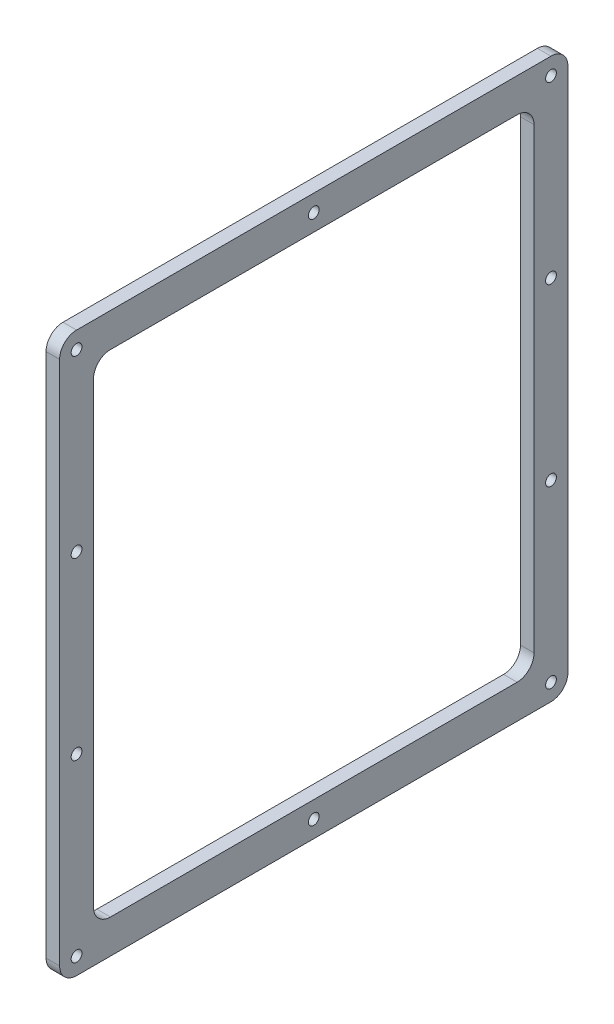
ISO-10303-21;
HEADER;
FILE_DESCRIPTION(('STEP AP214'),'2;1');
FILE_NAME('part.step','',(''),(''),'','','');
FILE_SCHEMA(('AUTOMOTIVE_DESIGN { 1 0 10303 214 1 1 1 1 }'));
ENDSEC;
DATA;
#1=APPLICATION_CONTEXT('core data for automotive mechanical design processes');
#2=APPLICATION_PROTOCOL_DEFINITION('international standard','automotive_design',2000,#1);
#3=PRODUCT_CONTEXT('',#1,'mechanical');
#4=PRODUCT('Part','Part','',(#3));
#5=PRODUCT_RELATED_PRODUCT_CATEGORY('part','',(#4));
#6=PRODUCT_DEFINITION_FORMATION('','',#4);
#7=PRODUCT_DEFINITION_CONTEXT('part definition',#1,'design');
#8=PRODUCT_DEFINITION('design','',#6,#7);
#9=PRODUCT_DEFINITION_SHAPE('','',#8);
#10=(LENGTH_UNIT() NAMED_UNIT(*) SI_UNIT(.MILLI.,.METRE.));
#11=(NAMED_UNIT(*) PLANE_ANGLE_UNIT() SI_UNIT($,.RADIAN.));
#12=(NAMED_UNIT(*) SI_UNIT($,.STERADIAN.) SOLID_ANGLE_UNIT());
#13=UNCERTAINTY_MEASURE_WITH_UNIT(LENGTH_MEASURE(1.E-05),#10,'distance_accuracy_value','');
#14=(GEOMETRIC_REPRESENTATION_CONTEXT(3) GLOBAL_UNCERTAINTY_ASSIGNED_CONTEXT((#13)) GLOBAL_UNIT_ASSIGNED_CONTEXT((#10,
#11,#12)) REPRESENTATION_CONTEXT('',''));
#15=CARTESIAN_POINT('',(0.,0.,0.));
#16=DIRECTION('',(0.,0.,1.));
#17=DIRECTION('',(1.,0.,0.));
#18=AXIS2_PLACEMENT_3D('',#15,#16,#17);
#19=CARTESIAN_POINT('',(5.08,0.,0.));
#20=DIRECTION('',(-1.,0.,0.));
#21=DIRECTION('',(0.,0.,1.));
#22=AXIS2_PLACEMENT_3D('',#19,#20,#21);
#23=PLANE('',#22);
#24=CARTESIAN_POINT('',(5.08,203.2,-6.35));
#25=DIRECTION('',(1.,0.,0.));
#26=DIRECTION('',(0.,0.,-1.));
#27=AXIS2_PLACEMENT_3D('',#24,#25,#26);
#28=CIRCLE('',#27,2.0193);
#29=CARTESIAN_POINT('',(5.08,203.2,-8.3693));
#30=VERTEX_POINT('',#29);
#31=EDGE_CURVE('E656',#30,#30,#28,.T.);
#32=ORIENTED_EDGE('',*,*,#31,.F.);
#33=EDGE_LOOP('',(#32));
#34=FACE_BOUND('',#33,.T.);
#35=CARTESIAN_POINT('',(5.08,6.35000000000003,-184.15));
#36=DIRECTION('',(1.,0.,0.));
#37=DIRECTION('',(0.,0.,-1.));
#38=AXIS2_PLACEMENT_3D('',#35,#36,#37);
#39=CIRCLE('',#38,2.0193);
#40=CARTESIAN_POINT('',(5.08,6.35000000000003,-186.1693));
#41=VERTEX_POINT('',#40);
#42=EDGE_CURVE('E651',#41,#41,#39,.T.);
#43=ORIENTED_EDGE('',*,*,#42,.F.);
#44=EDGE_LOOP('',(#43));
#45=FACE_BOUND('',#44,.T.);
#46=CARTESIAN_POINT('',(5.08,6.35,-6.35000000000003));
#47=DIRECTION('',(1.,0.,0.));
#48=DIRECTION('',(0.,0.,-1.));
#49=AXIS2_PLACEMENT_3D('',#46,#47,#48);
#50=CIRCLE('',#49,2.0193);
#51=CARTESIAN_POINT('',(5.08,6.35,-8.36930000000003));
#52=VERTEX_POINT('',#51);
#53=EDGE_CURVE('E645',#52,#52,#50,.T.);
#54=ORIENTED_EDGE('',*,*,#53,.F.);
#55=EDGE_LOOP('',(#54));
#56=FACE_BOUND('',#55,.T.);
#57=CARTESIAN_POINT('',(5.08,203.2,-184.15));
#58=DIRECTION('',(1.,0.,0.));
#59=DIRECTION('',(0.,0.,-1.));
#60=AXIS2_PLACEMENT_3D('',#57,#58,#59);
#61=CIRCLE('',#60,2.0193);
#62=CARTESIAN_POINT('',(5.08,203.2,-186.1693));
#63=VERTEX_POINT('',#62);
#64=EDGE_CURVE('E639',#63,#63,#61,.T.);
#65=ORIENTED_EDGE('',*,*,#64,.F.);
#66=EDGE_LOOP('',(#65));
#67=FACE_BOUND('',#66,.T.);
#68=CARTESIAN_POINT('',(5.08,6.35,-95.25));
#69=DIRECTION('',(1.,0.,0.));
#70=DIRECTION('',(0.,0.,-1.));
#71=AXIS2_PLACEMENT_3D('',#68,#69,#70);
#72=CIRCLE('',#71,2.0193);
#73=CARTESIAN_POINT('',(5.08,6.35,-97.2693));
#74=VERTEX_POINT('',#73);
#75=EDGE_CURVE('E633',#74,#74,#72,.T.);
#76=ORIENTED_EDGE('',*,*,#75,.F.);
#77=EDGE_LOOP('',(#76));
#78=FACE_BOUND('',#77,.T.);
#79=CARTESIAN_POINT('',(5.08,203.2,-95.25));
#80=DIRECTION('',(1.,0.,0.));
#81=DIRECTION('',(0.,0.,-1.));
#82=AXIS2_PLACEMENT_3D('',#79,#80,#81);
#83=CIRCLE('',#82,2.0193);
#84=CARTESIAN_POINT('',(5.08,203.2,-97.2693));
#85=VERTEX_POINT('',#84);
#86=EDGE_CURVE('E627',#85,#85,#83,.T.);
#87=ORIENTED_EDGE('',*,*,#86,.F.);
#88=EDGE_LOOP('',(#87));
#89=FACE_BOUND('',#88,.T.);
#90=CARTESIAN_POINT('',(5.08,137.583333333333,-6.35000000000001));
#91=DIRECTION('',(1.,0.,0.));
#92=DIRECTION('',(0.,0.,-1.));
#93=AXIS2_PLACEMENT_3D('',#90,#91,#92);
#94=CIRCLE('',#93,2.0193);
#95=CARTESIAN_POINT('',(5.08,137.583333333333,-8.36930000000001));
#96=VERTEX_POINT('',#95);
#97=EDGE_CURVE('E621',#96,#96,#94,.T.);
#98=ORIENTED_EDGE('',*,*,#97,.F.);
#99=EDGE_LOOP('',(#98));
#100=FACE_BOUND('',#99,.T.);
#101=CARTESIAN_POINT('',(5.08,71.9666666666667,-6.35000000000002));
#102=DIRECTION('',(1.,0.,0.));
#103=DIRECTION('',(0.,0.,-1.));
#104=AXIS2_PLACEMENT_3D('',#101,#102,#103);
#105=CIRCLE('',#104,2.0193);
#106=CARTESIAN_POINT('',(5.08,71.9666666666667,-8.36930000000002));
#107=VERTEX_POINT('',#106);
#108=EDGE_CURVE('E615',#107,#107,#105,.T.);
#109=ORIENTED_EDGE('',*,*,#108,.F.);
#110=EDGE_LOOP('',(#109));
#111=FACE_BOUND('',#110,.T.);
#112=CARTESIAN_POINT('',(5.08,71.9666666666667,-184.15));
#113=DIRECTION('',(1.,0.,0.));
#114=DIRECTION('',(0.,0.,-1.));
#115=AXIS2_PLACEMENT_3D('',#112,#113,#114);
#116=CIRCLE('',#115,2.0193);
#117=CARTESIAN_POINT('',(5.08,71.9666666666667,-186.1693));
#118=VERTEX_POINT('',#117);
#119=EDGE_CURVE('E601',#118,#118,#116,.T.);
#120=ORIENTED_EDGE('',*,*,#119,.F.);
#121=EDGE_LOOP('',(#120));
#122=FACE_BOUND('',#121,.T.);
#123=CARTESIAN_POINT('',(5.08,137.583333333333,-184.15));
#124=DIRECTION('',(1.,0.,0.));
#125=DIRECTION('',(0.,0.,-1.));
#126=AXIS2_PLACEMENT_3D('',#123,#124,#125);
#127=CIRCLE('',#126,2.0193);
#128=CARTESIAN_POINT('',(5.08,137.583333333333,-186.1693));
#129=VERTEX_POINT('',#128);
#130=EDGE_CURVE('E595',#129,#129,#127,.T.);
#131=ORIENTED_EDGE('',*,*,#130,.F.);
#132=EDGE_LOOP('',(#131));
#133=FACE_BOUND('',#132,.T.);
#134=DIRECTION('',(0.,0.,-1.));
#135=VECTOR('',#134,1.);
#136=CARTESIAN_POINT('',(5.08,0.,0.));
#137=LINE('',#136,#135);
#138=CARTESIAN_POINT('',(5.08,0.,-6.35));
#139=VERTEX_POINT('',#138);
#140=CARTESIAN_POINT('',(5.08,0.,-184.15));
#141=VERTEX_POINT('',#140);
#142=EDGE_CURVE('E271',#139,#141,#137,.T.);
#143=ORIENTED_EDGE('',*,*,#142,.T.);
#144=CARTESIAN_POINT('',(5.08,6.35,-184.15));
#145=DIRECTION('',(-1.,0.,0.));
#146=DIRECTION('',(0.,0.,1.));
#147=AXIS2_PLACEMENT_3D('',#144,#145,#146);
#148=CIRCLE('',#147,6.35);
#149=CARTESIAN_POINT('',(5.08,6.35,-190.5));
#150=VERTEX_POINT('',#149);
#151=EDGE_CURVE('E210',#141,#150,#148,.F.);
#152=ORIENTED_EDGE('',*,*,#151,.T.);
#153=DIRECTION('',(0.,1.,0.));
#154=VECTOR('',#153,1.);
#155=CARTESIAN_POINT('',(5.08,0.,-190.5));
#156=LINE('',#155,#154);
#157=CARTESIAN_POINT('',(5.08,203.2,-190.5));
#158=VERTEX_POINT('',#157);
#159=EDGE_CURVE('E176',#150,#158,#156,.T.);
#160=ORIENTED_EDGE('',*,*,#159,.T.);
#161=CARTESIAN_POINT('',(5.08,203.2,-184.15));
#162=DIRECTION('',(-1.,0.,0.));
#163=DIRECTION('',(0.,0.,1.));
#164=AXIS2_PLACEMENT_3D('',#161,#162,#163);
#165=CIRCLE('',#164,6.35);
#166=CARTESIAN_POINT('',(5.08,209.55,-184.15));
#167=VERTEX_POINT('',#166);
#168=EDGE_CURVE('E208',#158,#167,#165,.F.);
#169=ORIENTED_EDGE('',*,*,#168,.T.);
#170=DIRECTION('',(0.,0.,1.));
#171=VECTOR('',#170,1.);
#172=CARTESIAN_POINT('',(5.08,209.55,0.));
#173=LINE('',#172,#171);
#174=CARTESIAN_POINT('',(5.08,209.55,-6.35));
#175=VERTEX_POINT('',#174);
#176=EDGE_CURVE('E171',#167,#175,#173,.T.);
#177=ORIENTED_EDGE('',*,*,#176,.T.);
#178=CARTESIAN_POINT('',(5.08,203.2,-6.35));
#179=DIRECTION('',(-1.,0.,0.));
#180=DIRECTION('',(0.,0.,1.));
#181=AXIS2_PLACEMENT_3D('',#178,#179,#180);
#182=CIRCLE('',#181,6.35);
#183=CARTESIAN_POINT('',(5.08,203.2,0.));
#184=VERTEX_POINT('',#183);
#185=EDGE_CURVE('E206',#175,#184,#182,.F.);
#186=ORIENTED_EDGE('',*,*,#185,.T.);
#187=DIRECTION('',(0.,-1.,0.));
#188=VECTOR('',#187,1.);
#189=CARTESIAN_POINT('',(5.08,0.,0.));
#190=LINE('',#189,#188);
#191=CARTESIAN_POINT('',(5.08,6.35,0.));
#192=VERTEX_POINT('',#191);
#193=EDGE_CURVE('E268',#184,#192,#190,.T.);
#194=ORIENTED_EDGE('',*,*,#193,.T.);
#195=CARTESIAN_POINT('',(5.08,6.35,-6.35));
#196=DIRECTION('',(-1.,0.,0.));
#197=DIRECTION('',(0.,0.,1.));
#198=AXIS2_PLACEMENT_3D('',#195,#196,#197);
#199=CIRCLE('',#198,6.35);
#200=EDGE_CURVE('E204',#192,#139,#199,.F.);
#201=ORIENTED_EDGE('',*,*,#200,.T.);
#202=EDGE_LOOP('',(#143,#152,#160,#169,#177,#186,#194,#201));
#203=FACE_BOUND('',#202,.T.);
#204=DIRECTION('',(0.,-1.,0.));
#205=VECTOR('',#204,1.);
#206=CARTESIAN_POINT('',(5.08,196.85,-12.7));
#207=LINE('',#206,#205);
#208=CARTESIAN_POINT('',(5.08,190.5,-12.7));
#209=VERTEX_POINT('',#208);
#210=CARTESIAN_POINT('',(5.08,19.05,-12.7));
#211=VERTEX_POINT('',#210);
#212=EDGE_CURVE('E267',#209,#211,#207,.T.);
#213=ORIENTED_EDGE('',*,*,#212,.F.);
#214=CARTESIAN_POINT('',(5.08,190.5,-19.05));
#215=DIRECTION('',(-1.,0.,0.));
#216=DIRECTION('',(0.,0.,1.));
#217=AXIS2_PLACEMENT_3D('',#214,#215,#216);
#218=CIRCLE('',#217,6.35);
#219=CARTESIAN_POINT('',(5.08,196.85,-19.05));
#220=VERTEX_POINT('',#219);
#221=EDGE_CURVE('E51',#209,#220,#218,.T.);
#222=ORIENTED_EDGE('',*,*,#221,.T.);
#223=DIRECTION('',(0.,0.,1.));
#224=VECTOR('',#223,1.);
#225=CARTESIAN_POINT('',(5.08,196.85,-12.7));
#226=LINE('',#225,#224);
#227=CARTESIAN_POINT('',(5.08,196.85,-171.45));
#228=VERTEX_POINT('',#227);
#229=EDGE_CURVE('E252',#228,#220,#226,.T.);
#230=ORIENTED_EDGE('',*,*,#229,.F.);
#231=CARTESIAN_POINT('',(5.08,190.5,-171.45));
#232=DIRECTION('',(-1.,0.,0.));
#233=DIRECTION('',(0.,0.,1.));
#234=AXIS2_PLACEMENT_3D('',#231,#232,#233);
#235=CIRCLE('',#234,6.35);
#236=CARTESIAN_POINT('',(5.08,190.5,-177.8));
#237=VERTEX_POINT('',#236);
#238=EDGE_CURVE('E236',#228,#237,#235,.T.);
#239=ORIENTED_EDGE('',*,*,#238,.T.);
#240=DIRECTION('',(0.,1.,0.));
#241=VECTOR('',#240,1.);
#242=CARTESIAN_POINT('',(5.08,196.85,-177.8));
#243=LINE('',#242,#241);
#244=CARTESIAN_POINT('',(5.08,19.05,-177.8));
#245=VERTEX_POINT('',#244);
#246=EDGE_CURVE('E255',#245,#237,#243,.T.);
#247=ORIENTED_EDGE('',*,*,#246,.F.);
#248=CARTESIAN_POINT('',(5.08,19.05,-171.45));
#249=DIRECTION('',(-1.,0.,0.));
#250=DIRECTION('',(0.,0.,1.));
#251=AXIS2_PLACEMENT_3D('',#248,#249,#250);
#252=CIRCLE('',#251,6.35);
#253=CARTESIAN_POINT('',(5.08,12.7,-171.45));
#254=VERTEX_POINT('',#253);
#255=EDGE_CURVE('E232',#245,#254,#252,.T.);
#256=ORIENTED_EDGE('',*,*,#255,.T.);
#257=DIRECTION('',(0.,0.,-1.));
#258=VECTOR('',#257,1.);
#259=CARTESIAN_POINT('',(5.08,12.7,-12.7));
#260=LINE('',#259,#258);
#261=CARTESIAN_POINT('',(5.08,12.7,-19.05));
#262=VERTEX_POINT('',#261);
#263=EDGE_CURVE('E261',#262,#254,#260,.T.);
#264=ORIENTED_EDGE('',*,*,#263,.F.);
#265=CARTESIAN_POINT('',(5.08,19.05,-19.05));
#266=DIRECTION('',(-1.,0.,0.));
#267=DIRECTION('',(0.,0.,1.));
#268=AXIS2_PLACEMENT_3D('',#265,#266,#267);
#269=CIRCLE('',#268,6.35);
#270=EDGE_CURVE('E11',#262,#211,#269,.T.);
#271=ORIENTED_EDGE('',*,*,#270,.T.);
#272=EDGE_LOOP('',(#213,#222,#230,#239,#247,#256,#264,#271));
#273=FACE_BOUND('',#272,.T.);
#274=ADVANCED_FACE('F36',(#34,#45,#56,#67,#78,#89,#100,#111,#122,#133,#203,#273),#23,.F.);
#275=CARTESIAN_POINT('',(0.,0.,0.));
#276=DIRECTION('',(-1.,0.,0.));
#277=DIRECTION('',(0.,0.,1.));
#278=AXIS2_PLACEMENT_3D('',#275,#276,#277);
#279=PLANE('',#278);
#280=CARTESIAN_POINT('',(0.,203.2,-6.35));
#281=DIRECTION('',(1.,0.,0.));
#282=DIRECTION('',(0.,0.,-1.));
#283=AXIS2_PLACEMENT_3D('',#280,#281,#282);
#284=CIRCLE('',#283,2.0193);
#285=CARTESIAN_POINT('',(0.,203.2,-8.3693));
#286=VERTEX_POINT('',#285);
#287=EDGE_CURVE('E654',#286,#286,#284,.T.);
#288=ORIENTED_EDGE('',*,*,#287,.T.);
#289=EDGE_LOOP('',(#288));
#290=FACE_BOUND('',#289,.T.);
#291=CARTESIAN_POINT('',(0.,6.35000000000003,-184.15));
#292=DIRECTION('',(1.,0.,0.));
#293=DIRECTION('',(0.,0.,-1.));
#294=AXIS2_PLACEMENT_3D('',#291,#292,#293);
#295=CIRCLE('',#294,2.0193);
#296=CARTESIAN_POINT('',(0.,6.35000000000003,-186.1693));
#297=VERTEX_POINT('',#296);
#298=EDGE_CURVE('E648',#297,#297,#295,.T.);
#299=ORIENTED_EDGE('',*,*,#298,.T.);
#300=EDGE_LOOP('',(#299));
#301=FACE_BOUND('',#300,.T.);
#302=CARTESIAN_POINT('',(0.,6.35,-6.35000000000003));
#303=DIRECTION('',(1.,0.,0.));
#304=DIRECTION('',(0.,0.,-1.));
#305=AXIS2_PLACEMENT_3D('',#302,#303,#304);
#306=CIRCLE('',#305,2.0193);
#307=CARTESIAN_POINT('',(0.,6.35,-8.36930000000003));
#308=VERTEX_POINT('',#307);
#309=EDGE_CURVE('E642',#308,#308,#306,.T.);
#310=ORIENTED_EDGE('',*,*,#309,.T.);
#311=EDGE_LOOP('',(#310));
#312=FACE_BOUND('',#311,.T.);
#313=CARTESIAN_POINT('',(0.,203.2,-184.15));
#314=DIRECTION('',(1.,0.,0.));
#315=DIRECTION('',(0.,0.,-1.));
#316=AXIS2_PLACEMENT_3D('',#313,#314,#315);
#317=CIRCLE('',#316,2.0193);
#318=CARTESIAN_POINT('',(0.,203.2,-186.1693));
#319=VERTEX_POINT('',#318);
#320=EDGE_CURVE('E636',#319,#319,#317,.T.);
#321=ORIENTED_EDGE('',*,*,#320,.T.);
#322=EDGE_LOOP('',(#321));
#323=FACE_BOUND('',#322,.T.);
#324=CARTESIAN_POINT('',(0.,6.35,-95.25));
#325=DIRECTION('',(1.,0.,0.));
#326=DIRECTION('',(0.,0.,-1.));
#327=AXIS2_PLACEMENT_3D('',#324,#325,#326);
#328=CIRCLE('',#327,2.0193);
#329=CARTESIAN_POINT('',(0.,6.35,-97.2693));
#330=VERTEX_POINT('',#329);
#331=EDGE_CURVE('E630',#330,#330,#328,.T.);
#332=ORIENTED_EDGE('',*,*,#331,.T.);
#333=EDGE_LOOP('',(#332));
#334=FACE_BOUND('',#333,.T.);
#335=CARTESIAN_POINT('',(0.,203.2,-95.25));
#336=DIRECTION('',(1.,0.,0.));
#337=DIRECTION('',(0.,0.,-1.));
#338=AXIS2_PLACEMENT_3D('',#335,#336,#337);
#339=CIRCLE('',#338,2.0193);
#340=CARTESIAN_POINT('',(0.,203.2,-97.2693));
#341=VERTEX_POINT('',#340);
#342=EDGE_CURVE('E624',#341,#341,#339,.T.);
#343=ORIENTED_EDGE('',*,*,#342,.T.);
#344=EDGE_LOOP('',(#343));
#345=FACE_BOUND('',#344,.T.);
#346=CARTESIAN_POINT('',(0.,137.583333333333,-6.35000000000001));
#347=DIRECTION('',(1.,0.,0.));
#348=DIRECTION('',(0.,0.,-1.));
#349=AXIS2_PLACEMENT_3D('',#346,#347,#348);
#350=CIRCLE('',#349,2.0193);
#351=CARTESIAN_POINT('',(0.,137.583333333333,-8.36930000000001));
#352=VERTEX_POINT('',#351);
#353=EDGE_CURVE('E618',#352,#352,#350,.T.);
#354=ORIENTED_EDGE('',*,*,#353,.T.);
#355=EDGE_LOOP('',(#354));
#356=FACE_BOUND('',#355,.T.);
#357=CARTESIAN_POINT('',(0.,71.9666666666667,-6.35000000000002));
#358=DIRECTION('',(1.,0.,0.));
#359=DIRECTION('',(0.,0.,-1.));
#360=AXIS2_PLACEMENT_3D('',#357,#358,#359);
#361=CIRCLE('',#360,2.0193);
#362=CARTESIAN_POINT('',(0.,71.9666666666667,-8.36930000000002));
#363=VERTEX_POINT('',#362);
#364=EDGE_CURVE('E612',#363,#363,#361,.T.);
#365=ORIENTED_EDGE('',*,*,#364,.T.);
#366=EDGE_LOOP('',(#365));
#367=FACE_BOUND('',#366,.T.);
#368=CARTESIAN_POINT('',(0.,71.9666666666667,-184.15));
#369=DIRECTION('',(1.,0.,0.));
#370=DIRECTION('',(0.,0.,-1.));
#371=AXIS2_PLACEMENT_3D('',#368,#369,#370);
#372=CIRCLE('',#371,2.0193);
#373=CARTESIAN_POINT('',(0.,71.9666666666667,-186.1693));
#374=VERTEX_POINT('',#373);
#375=EDGE_CURVE('E597',#374,#374,#372,.T.);
#376=ORIENTED_EDGE('',*,*,#375,.T.);
#377=EDGE_LOOP('',(#376));
#378=FACE_BOUND('',#377,.T.);
#379=CARTESIAN_POINT('',(0.,137.583333333333,-184.15));
#380=DIRECTION('',(1.,0.,0.));
#381=DIRECTION('',(0.,0.,-1.));
#382=AXIS2_PLACEMENT_3D('',#379,#380,#381);
#383=CIRCLE('',#382,2.0193);
#384=CARTESIAN_POINT('',(0.,137.583333333333,-186.1693));
#385=VERTEX_POINT('',#384);
#386=EDGE_CURVE('E248',#385,#385,#383,.T.);
#387=ORIENTED_EDGE('',*,*,#386,.T.);
#388=EDGE_LOOP('',(#387));
#389=FACE_BOUND('',#388,.T.);
#390=DIRECTION('',(0.,1.,0.));
#391=VECTOR('',#390,1.);
#392=CARTESIAN_POINT('',(0.,0.,-190.5));
#393=LINE('',#392,#391);
#394=CARTESIAN_POINT('',(0.,6.35,-190.5));
#395=VERTEX_POINT('',#394);
#396=CARTESIAN_POINT('',(0.,203.2,-190.5));
#397=VERTEX_POINT('',#396);
#398=EDGE_CURVE('E277',#395,#397,#393,.T.);
#399=ORIENTED_EDGE('',*,*,#398,.F.);
#400=CARTESIAN_POINT('',(0.,6.35,-184.15));
#401=DIRECTION('',(-1.,0.,0.));
#402=DIRECTION('',(0.,0.,1.));
#403=AXIS2_PLACEMENT_3D('',#400,#401,#402);
#404=CIRCLE('',#403,6.35);
#405=CARTESIAN_POINT('',(0.,0.,-184.15));
#406=VERTEX_POINT('',#405);
#407=EDGE_CURVE('E197',#395,#406,#404,.T.);
#408=ORIENTED_EDGE('',*,*,#407,.T.);
#409=DIRECTION('',(0.,0.,-1.));
#410=VECTOR('',#409,1.);
#411=CARTESIAN_POINT('',(0.,0.,0.));
#412=LINE('',#411,#410);
#413=CARTESIAN_POINT('',(0.,0.,-6.35));
#414=VERTEX_POINT('',#413);
#415=EDGE_CURVE('E258',#414,#406,#412,.T.);
#416=ORIENTED_EDGE('',*,*,#415,.F.);
#417=CARTESIAN_POINT('',(0.,6.35,-6.35));
#418=DIRECTION('',(-1.,0.,0.));
#419=DIRECTION('',(0.,0.,1.));
#420=AXIS2_PLACEMENT_3D('',#417,#418,#419);
#421=CIRCLE('',#420,6.35);
#422=CARTESIAN_POINT('',(0.,6.35,0.));
#423=VERTEX_POINT('',#422);
#424=EDGE_CURVE('E191',#414,#423,#421,.T.);
#425=ORIENTED_EDGE('',*,*,#424,.T.);
#426=DIRECTION('',(0.,-1.,0.));
#427=VECTOR('',#426,1.);
#428=CARTESIAN_POINT('',(0.,0.,0.));
#429=LINE('',#428,#427);
#430=CARTESIAN_POINT('',(0.,203.2,0.));
#431=VERTEX_POINT('',#430);
#432=EDGE_CURVE('E254',#431,#423,#429,.T.);
#433=ORIENTED_EDGE('',*,*,#432,.F.);
#434=CARTESIAN_POINT('',(0.,203.2,-6.35));
#435=DIRECTION('',(-1.,0.,0.));
#436=DIRECTION('',(0.,0.,1.));
#437=AXIS2_PLACEMENT_3D('',#434,#435,#436);
#438=CIRCLE('',#437,6.35);
#439=CARTESIAN_POINT('',(0.,209.55,-6.35));
#440=VERTEX_POINT('',#439);
#441=EDGE_CURVE('E193',#431,#440,#438,.T.);
#442=ORIENTED_EDGE('',*,*,#441,.T.);
#443=DIRECTION('',(0.,0.,1.));
#444=VECTOR('',#443,1.);
#445=CARTESIAN_POINT('',(0.,209.55,0.));
#446=LINE('',#445,#444);
#447=CARTESIAN_POINT('',(0.,209.55,-184.15));
#448=VERTEX_POINT('',#447);
#449=EDGE_CURVE('E179',#448,#440,#446,.T.);
#450=ORIENTED_EDGE('',*,*,#449,.F.);
#451=CARTESIAN_POINT('',(0.,203.2,-184.15));
#452=DIRECTION('',(-1.,0.,0.));
#453=DIRECTION('',(0.,0.,1.));
#454=AXIS2_PLACEMENT_3D('',#451,#452,#453);
#455=CIRCLE('',#454,6.35);
#456=EDGE_CURVE('E195',#448,#397,#455,.T.);
#457=ORIENTED_EDGE('',*,*,#456,.T.);
#458=EDGE_LOOP('',(#399,#408,#416,#425,#433,#442,#450,#457));
#459=FACE_BOUND('',#458,.T.);
#460=DIRECTION('',(0.,1.,0.));
#461=VECTOR('',#460,1.);
#462=CARTESIAN_POINT('',(0.,196.85,-177.8));
#463=LINE('',#462,#461);
#464=CARTESIAN_POINT('',(0.,19.05,-177.8));
#465=VERTEX_POINT('',#464);
#466=CARTESIAN_POINT('',(0.,190.5,-177.8));
#467=VERTEX_POINT('',#466);
#468=EDGE_CURVE('E168',#465,#467,#463,.T.);
#469=ORIENTED_EDGE('',*,*,#468,.T.);
#470=CARTESIAN_POINT('',(0.,190.5,-171.45));
#471=DIRECTION('',(-1.,0.,0.));
#472=DIRECTION('',(0.,0.,1.));
#473=AXIS2_PLACEMENT_3D('',#470,#471,#472);
#474=CIRCLE('',#473,6.35);
#475=CARTESIAN_POINT('',(0.,196.85,-171.45));
#476=VERTEX_POINT('',#475);
#477=EDGE_CURVE('E234',#467,#476,#474,.F.);
#478=ORIENTED_EDGE('',*,*,#477,.T.);
#479=DIRECTION('',(0.,0.,1.));
#480=VECTOR('',#479,1.);
#481=CARTESIAN_POINT('',(0.,196.85,-12.7));
#482=LINE('',#481,#480);
#483=CARTESIAN_POINT('',(0.,196.85,-19.05));
#484=VERTEX_POINT('',#483);
#485=EDGE_CURVE('E241',#476,#484,#482,.T.);
#486=ORIENTED_EDGE('',*,*,#485,.T.);
#487=CARTESIAN_POINT('',(0.,190.5,-19.05));
#488=DIRECTION('',(-1.,0.,0.));
#489=DIRECTION('',(0.,0.,1.));
#490=AXIS2_PLACEMENT_3D('',#487,#488,#489);
#491=CIRCLE('',#490,6.35);
#492=CARTESIAN_POINT('',(0.,190.5,-12.7));
#493=VERTEX_POINT('',#492);
#494=EDGE_CURVE('E238',#484,#493,#491,.F.);
#495=ORIENTED_EDGE('',*,*,#494,.T.);
#496=DIRECTION('',(0.,-1.,0.));
#497=VECTOR('',#496,1.);
#498=CARTESIAN_POINT('',(0.,196.85,-12.7));
#499=LINE('',#498,#497);
#500=CARTESIAN_POINT('',(0.,19.05,-12.7));
#501=VERTEX_POINT('',#500);
#502=EDGE_CURVE('E155',#493,#501,#499,.T.);
#503=ORIENTED_EDGE('',*,*,#502,.T.);
#504=CARTESIAN_POINT('',(0.,19.05,-19.05));
#505=DIRECTION('',(-1.,0.,0.));
#506=DIRECTION('',(0.,0.,1.));
#507=AXIS2_PLACEMENT_3D('',#504,#505,#506);
#508=CIRCLE('',#507,6.35);
#509=CARTESIAN_POINT('',(0.,12.7,-19.05));
#510=VERTEX_POINT('',#509);
#511=EDGE_CURVE('E44',#501,#510,#508,.F.);
#512=ORIENTED_EDGE('',*,*,#511,.T.);
#513=DIRECTION('',(0.,0.,-1.));
#514=VECTOR('',#513,1.);
#515=CARTESIAN_POINT('',(0.,12.7,-12.7));
#516=LINE('',#515,#514);
#517=CARTESIAN_POINT('',(0.,12.7,-171.45));
#518=VERTEX_POINT('',#517);
#519=EDGE_CURVE('E153',#510,#518,#516,.T.);
#520=ORIENTED_EDGE('',*,*,#519,.T.);
#521=CARTESIAN_POINT('',(0.,19.05,-171.45));
#522=DIRECTION('',(-1.,0.,0.));
#523=DIRECTION('',(0.,0.,1.));
#524=AXIS2_PLACEMENT_3D('',#521,#522,#523);
#525=CIRCLE('',#524,6.35);
#526=EDGE_CURVE('E230',#518,#465,#525,.F.);
#527=ORIENTED_EDGE('',*,*,#526,.T.);
#528=EDGE_LOOP('',(#469,#478,#486,#495,#503,#512,#520,#527));
#529=FACE_BOUND('',#528,.T.);
#530=ADVANCED_FACE('F152',(#290,#301,#312,#323,#334,#345,#356,#367,#378,#389,#459,#529),#279,.T.);
#531=CARTESIAN_POINT('',(5.08,0.,0.));
#532=DIRECTION('',(0.,0.,-1.));
#533=DIRECTION('',(-1.,0.,0.));
#534=AXIS2_PLACEMENT_3D('',#531,#532,#533);
#535=PLANE('',#534);
#536=ORIENTED_EDGE('',*,*,#193,.F.);
#537=DIRECTION('',(-1.,0.,0.));
#538=VECTOR('',#537,1.);
#539=CARTESIAN_POINT('',(5.08,203.2,0.));
#540=LINE('',#539,#538);
#541=EDGE_CURVE('E223',#184,#431,#540,.T.);
#542=ORIENTED_EDGE('',*,*,#541,.T.);
#543=ORIENTED_EDGE('',*,*,#432,.T.);
#544=DIRECTION('',(-1.,0.,0.));
#545=VECTOR('',#544,1.);
#546=CARTESIAN_POINT('',(5.08,6.35,0.));
#547=LINE('',#546,#545);
#548=EDGE_CURVE('E221',#423,#192,#547,.F.);
#549=ORIENTED_EDGE('',*,*,#548,.T.);
#550=EDGE_LOOP('',(#536,#542,#543,#549));
#551=FACE_BOUND('',#550,.T.);
#552=ADVANCED_FACE('F298',(#551),#535,.F.);
#553=CARTESIAN_POINT('',(5.08,0.,0.));
#554=DIRECTION('',(0.,1.,0.));
#555=DIRECTION('',(0.,0.,1.));
#556=AXIS2_PLACEMENT_3D('',#553,#554,#555);
#557=PLANE('',#556);
#558=ORIENTED_EDGE('',*,*,#415,.T.);
#559=DIRECTION('',(-1.,0.,0.));
#560=VECTOR('',#559,1.);
#561=CARTESIAN_POINT('',(5.08,0.,-184.15));
#562=LINE('',#561,#560);
#563=EDGE_CURVE('E202',#406,#141,#562,.F.);
#564=ORIENTED_EDGE('',*,*,#563,.T.);
#565=ORIENTED_EDGE('',*,*,#142,.F.);
#566=DIRECTION('',(-1.,0.,0.));
#567=VECTOR('',#566,1.);
#568=CARTESIAN_POINT('',(5.08,0.,-6.35));
#569=LINE('',#568,#567);
#570=EDGE_CURVE('E199',#139,#414,#569,.T.);
#571=ORIENTED_EDGE('',*,*,#570,.T.);
#572=EDGE_LOOP('',(#558,#564,#565,#571));
#573=FACE_BOUND('',#572,.T.);
#574=ADVANCED_FACE('F307',(#573),#557,.F.);
#575=CARTESIAN_POINT('',(5.08,0.,-190.5));
#576=DIRECTION('',(0.,0.,1.));
#577=DIRECTION('',(1.,0.,0.));
#578=AXIS2_PLACEMENT_3D('',#575,#576,#577);
#579=PLANE('',#578);
#580=ORIENTED_EDGE('',*,*,#159,.F.);
#581=DIRECTION('',(-1.,0.,0.));
#582=VECTOR('',#581,1.);
#583=CARTESIAN_POINT('',(5.08,6.35,-190.5));
#584=LINE('',#583,#582);
#585=EDGE_CURVE('E188',#150,#395,#584,.T.);
#586=ORIENTED_EDGE('',*,*,#585,.T.);
#587=ORIENTED_EDGE('',*,*,#398,.T.);
#588=DIRECTION('',(-1.,0.,0.));
#589=VECTOR('',#588,1.);
#590=CARTESIAN_POINT('',(5.08,203.2,-190.5));
#591=LINE('',#590,#589);
#592=EDGE_CURVE('E186',#397,#158,#591,.F.);
#593=ORIENTED_EDGE('',*,*,#592,.T.);
#594=EDGE_LOOP('',(#580,#586,#587,#593));
#595=FACE_BOUND('',#594,.T.);
#596=ADVANCED_FACE('F315',(#595),#579,.F.);
#597=CARTESIAN_POINT('',(5.08,209.55,0.));
#598=DIRECTION('',(0.,-1.,0.));
#599=DIRECTION('',(0.,0.,-1.));
#600=AXIS2_PLACEMENT_3D('',#597,#598,#599);
#601=PLANE('',#600);
#602=ORIENTED_EDGE('',*,*,#176,.F.);
#603=DIRECTION('',(-1.,0.,0.));
#604=VECTOR('',#603,1.);
#605=CARTESIAN_POINT('',(5.08,209.55,-184.15));
#606=LINE('',#605,#604);
#607=EDGE_CURVE('E214',#167,#448,#606,.T.);
#608=ORIENTED_EDGE('',*,*,#607,.T.);
#609=ORIENTED_EDGE('',*,*,#449,.T.);
#610=DIRECTION('',(-1.,0.,0.));
#611=VECTOR('',#610,1.);
#612=CARTESIAN_POINT('',(5.08,209.55,-6.35));
#613=LINE('',#612,#611);
#614=EDGE_CURVE('E212',#440,#175,#613,.F.);
#615=ORIENTED_EDGE('',*,*,#614,.T.);
#616=EDGE_LOOP('',(#602,#608,#609,#615));
#617=FACE_BOUND('',#616,.T.);
#618=ADVANCED_FACE('F287',(#617),#601,.F.);
#619=CARTESIAN_POINT('',(5.08,196.85,-12.7));
#620=DIRECTION('',(0.,0.,-1.));
#621=DIRECTION('',(0.,1.,0.));
#622=AXIS2_PLACEMENT_3D('',#619,#620,#621);
#623=PLANE('',#622);
#624=ORIENTED_EDGE('',*,*,#502,.F.);
#625=DIRECTION('',(-1.,0.,0.));
#626=VECTOR('',#625,1.);
#627=CARTESIAN_POINT('',(5.08,190.5,-12.7));
#628=LINE('',#627,#626);
#629=EDGE_CURVE('E228',#493,#209,#628,.F.);
#630=ORIENTED_EDGE('',*,*,#629,.T.);
#631=ORIENTED_EDGE('',*,*,#212,.T.);
#632=DIRECTION('',(-1.,0.,0.));
#633=VECTOR('',#632,1.);
#634=CARTESIAN_POINT('',(0.,19.05,-12.7));
#635=LINE('',#634,#633);
#636=EDGE_CURVE('E226',#211,#501,#635,.T.);
#637=ORIENTED_EDGE('',*,*,#636,.T.);
#638=EDGE_LOOP('',(#624,#630,#631,#637));
#639=FACE_BOUND('',#638,.T.);
#640=ADVANCED_FACE('F246',(#639),#623,.T.);
#641=CARTESIAN_POINT('',(5.08,12.7,-12.7));
#642=DIRECTION('',(0.,1.,0.));
#643=DIRECTION('',(0.,0.,1.));
#644=AXIS2_PLACEMENT_3D('',#641,#642,#643);
#645=PLANE('',#644);
#646=ORIENTED_EDGE('',*,*,#263,.T.);
#647=DIRECTION('',(-1.,0.,0.));
#648=VECTOR('',#647,1.);
#649=CARTESIAN_POINT('',(0.,12.7,-171.45));
#650=LINE('',#649,#648);
#651=EDGE_CURVE('E167',#254,#518,#650,.T.);
#652=ORIENTED_EDGE('',*,*,#651,.T.);
#653=ORIENTED_EDGE('',*,*,#519,.F.);
#654=DIRECTION('',(-1.,0.,0.));
#655=VECTOR('',#654,1.);
#656=CARTESIAN_POINT('',(5.08,12.7,-19.05));
#657=LINE('',#656,#655);
#658=EDGE_CURVE('E164',#510,#262,#657,.F.);
#659=ORIENTED_EDGE('',*,*,#658,.T.);
#660=EDGE_LOOP('',(#646,#652,#653,#659));
#661=FACE_BOUND('',#660,.T.);
#662=ADVANCED_FACE('F163',(#661),#645,.T.);
#663=CARTESIAN_POINT('',(5.08,196.85,-177.8));
#664=DIRECTION('',(0.,0.,1.));
#665=DIRECTION('',(0.,-1.,0.));
#666=AXIS2_PLACEMENT_3D('',#663,#664,#665);
#667=PLANE('',#666);
#668=ORIENTED_EDGE('',*,*,#468,.F.);
#669=DIRECTION('',(-1.,0.,0.));
#670=VECTOR('',#669,1.);
#671=CARTESIAN_POINT('',(5.08,19.05,-177.8));
#672=LINE('',#671,#670);
#673=EDGE_CURVE('E184',#465,#245,#672,.F.);
#674=ORIENTED_EDGE('',*,*,#673,.T.);
#675=ORIENTED_EDGE('',*,*,#246,.T.);
#676=DIRECTION('',(-1.,0.,0.));
#677=VECTOR('',#676,1.);
#678=CARTESIAN_POINT('',(0.,190.5,-177.8));
#679=LINE('',#678,#677);
#680=EDGE_CURVE('E173',#237,#467,#679,.T.);
#681=ORIENTED_EDGE('',*,*,#680,.T.);
#682=EDGE_LOOP('',(#668,#674,#675,#681));
#683=FACE_BOUND('',#682,.T.);
#684=ADVANCED_FACE('F412',(#683),#667,.T.);
#685=CARTESIAN_POINT('',(5.08,196.85,-12.7));
#686=DIRECTION('',(0.,-1.,0.));
#687=DIRECTION('',(0.,0.,-1.));
#688=AXIS2_PLACEMENT_3D('',#685,#686,#687);
#689=PLANE('',#688);
#690=ORIENTED_EDGE('',*,*,#485,.F.);
#691=DIRECTION('',(-1.,0.,0.));
#692=VECTOR('',#691,1.);
#693=CARTESIAN_POINT('',(5.08,196.85,-171.45));
#694=LINE('',#693,#692);
#695=EDGE_CURVE('E58',#476,#228,#694,.F.);
#696=ORIENTED_EDGE('',*,*,#695,.T.);
#697=ORIENTED_EDGE('',*,*,#229,.T.);
#698=DIRECTION('',(-1.,0.,0.));
#699=VECTOR('',#698,1.);
#700=CARTESIAN_POINT('',(0.,196.85,-19.05));
#701=LINE('',#700,#699);
#702=EDGE_CURVE('E217',#220,#484,#701,.T.);
#703=ORIENTED_EDGE('',*,*,#702,.T.);
#704=EDGE_LOOP('',(#690,#696,#697,#703));
#705=FACE_BOUND('',#704,.T.);
#706=ADVANCED_FACE('F251',(#705),#689,.T.);
#707=CARTESIAN_POINT('',(5.08,137.583333333333,-184.15));
#708=DIRECTION('',(1.,0.,0.));
#709=DIRECTION('',(0.,0.,-1.));
#710=AXIS2_PLACEMENT_3D('',#707,#708,#709);
#711=CYLINDRICAL_SURFACE('',#710,2.0193);
#712=ORIENTED_EDGE('',*,*,#386,.F.);
#713=EDGE_LOOP('',(#712));
#714=FACE_BOUND('',#713,.T.);
#715=ORIENTED_EDGE('',*,*,#130,.T.);
#716=EDGE_LOOP('',(#715));
#717=FACE_BOUND('',#716,.T.);
#718=ADVANCED_FACE('F411',(#714,#717),#711,.F.);
#719=CARTESIAN_POINT('',(5.08,71.9666666666667,-184.15));
#720=DIRECTION('',(1.,0.,0.));
#721=DIRECTION('',(0.,0.,-1.));
#722=AXIS2_PLACEMENT_3D('',#719,#720,#721);
#723=CYLINDRICAL_SURFACE('',#722,2.0193);
#724=ORIENTED_EDGE('',*,*,#375,.F.);
#725=EDGE_LOOP('',(#724));
#726=FACE_BOUND('',#725,.T.);
#727=ORIENTED_EDGE('',*,*,#119,.T.);
#728=EDGE_LOOP('',(#727));
#729=FACE_BOUND('',#728,.T.);
#730=ADVANCED_FACE('F557',(#726,#729),#723,.F.);
#731=CARTESIAN_POINT('',(5.08,71.9666666666667,-6.35000000000002));
#732=DIRECTION('',(1.,0.,0.));
#733=DIRECTION('',(0.,0.,-1.));
#734=AXIS2_PLACEMENT_3D('',#731,#732,#733);
#735=CYLINDRICAL_SURFACE('',#734,2.0193);
#736=ORIENTED_EDGE('',*,*,#364,.F.);
#737=EDGE_LOOP('',(#736));
#738=FACE_BOUND('',#737,.T.);
#739=ORIENTED_EDGE('',*,*,#108,.T.);
#740=EDGE_LOOP('',(#739));
#741=FACE_BOUND('',#740,.T.);
#742=ADVANCED_FACE('F546',(#738,#741),#735,.F.);
#743=CARTESIAN_POINT('',(5.08,137.583333333333,-6.35000000000001));
#744=DIRECTION('',(1.,0.,0.));
#745=DIRECTION('',(0.,0.,-1.));
#746=AXIS2_PLACEMENT_3D('',#743,#744,#745);
#747=CYLINDRICAL_SURFACE('',#746,2.0193);
#748=ORIENTED_EDGE('',*,*,#353,.F.);
#749=EDGE_LOOP('',(#748));
#750=FACE_BOUND('',#749,.T.);
#751=ORIENTED_EDGE('',*,*,#97,.T.);
#752=EDGE_LOOP('',(#751));
#753=FACE_BOUND('',#752,.T.);
#754=ADVANCED_FACE('F535',(#750,#753),#747,.F.);
#755=CARTESIAN_POINT('',(5.08,203.2,-95.25));
#756=DIRECTION('',(1.,0.,0.));
#757=DIRECTION('',(0.,0.,-1.));
#758=AXIS2_PLACEMENT_3D('',#755,#756,#757);
#759=CYLINDRICAL_SURFACE('',#758,2.0193);
#760=ORIENTED_EDGE('',*,*,#342,.F.);
#761=EDGE_LOOP('',(#760));
#762=FACE_BOUND('',#761,.T.);
#763=ORIENTED_EDGE('',*,*,#86,.T.);
#764=EDGE_LOOP('',(#763));
#765=FACE_BOUND('',#764,.T.);
#766=ADVANCED_FACE('F524',(#762,#765),#759,.F.);
#767=CARTESIAN_POINT('',(5.08,6.35,-95.25));
#768=DIRECTION('',(1.,0.,0.));
#769=DIRECTION('',(0.,0.,-1.));
#770=AXIS2_PLACEMENT_3D('',#767,#768,#769);
#771=CYLINDRICAL_SURFACE('',#770,2.0193);
#772=ORIENTED_EDGE('',*,*,#331,.F.);
#773=EDGE_LOOP('',(#772));
#774=FACE_BOUND('',#773,.T.);
#775=ORIENTED_EDGE('',*,*,#75,.T.);
#776=EDGE_LOOP('',(#775));
#777=FACE_BOUND('',#776,.T.);
#778=ADVANCED_FACE('F513',(#774,#777),#771,.F.);
#779=CARTESIAN_POINT('',(5.08,203.2,-184.15));
#780=DIRECTION('',(1.,0.,0.));
#781=DIRECTION('',(0.,0.,-1.));
#782=AXIS2_PLACEMENT_3D('',#779,#780,#781);
#783=CYLINDRICAL_SURFACE('',#782,2.0193);
#784=ORIENTED_EDGE('',*,*,#320,.F.);
#785=EDGE_LOOP('',(#784));
#786=FACE_BOUND('',#785,.T.);
#787=ORIENTED_EDGE('',*,*,#64,.T.);
#788=EDGE_LOOP('',(#787));
#789=FACE_BOUND('',#788,.T.);
#790=ADVANCED_FACE('F502',(#786,#789),#783,.F.);
#791=CARTESIAN_POINT('',(5.08,6.35,-6.35000000000003));
#792=DIRECTION('',(1.,0.,0.));
#793=DIRECTION('',(0.,0.,-1.));
#794=AXIS2_PLACEMENT_3D('',#791,#792,#793);
#795=CYLINDRICAL_SURFACE('',#794,2.0193);
#796=ORIENTED_EDGE('',*,*,#309,.F.);
#797=EDGE_LOOP('',(#796));
#798=FACE_BOUND('',#797,.T.);
#799=ORIENTED_EDGE('',*,*,#53,.T.);
#800=EDGE_LOOP('',(#799));
#801=FACE_BOUND('',#800,.T.);
#802=ADVANCED_FACE('F491',(#798,#801),#795,.F.);
#803=CARTESIAN_POINT('',(5.08,6.35000000000003,-184.15));
#804=DIRECTION('',(1.,0.,0.));
#805=DIRECTION('',(0.,0.,-1.));
#806=AXIS2_PLACEMENT_3D('',#803,#804,#805);
#807=CYLINDRICAL_SURFACE('',#806,2.0193);
#808=ORIENTED_EDGE('',*,*,#298,.F.);
#809=EDGE_LOOP('',(#808));
#810=FACE_BOUND('',#809,.T.);
#811=ORIENTED_EDGE('',*,*,#42,.T.);
#812=EDGE_LOOP('',(#811));
#813=FACE_BOUND('',#812,.T.);
#814=ADVANCED_FACE('F480',(#810,#813),#807,.F.);
#815=CARTESIAN_POINT('',(5.08,203.2,-6.35));
#816=DIRECTION('',(1.,0.,0.));
#817=DIRECTION('',(0.,0.,-1.));
#818=AXIS2_PLACEMENT_3D('',#815,#816,#817);
#819=CYLINDRICAL_SURFACE('',#818,2.0193);
#820=ORIENTED_EDGE('',*,*,#287,.F.);
#821=EDGE_LOOP('',(#820));
#822=FACE_BOUND('',#821,.T.);
#823=ORIENTED_EDGE('',*,*,#31,.T.);
#824=EDGE_LOOP('',(#823));
#825=FACE_BOUND('',#824,.T.);
#826=ADVANCED_FACE('F341',(#822,#825),#819,.F.);
#827=CARTESIAN_POINT('',(5.08,19.05,-171.45));
#828=DIRECTION('',(1.,0.,0.));
#829=DIRECTION('',(0.,0.,-1.));
#830=AXIS2_PLACEMENT_3D('',#827,#828,#829);
#831=CYLINDRICAL_SURFACE('',#830,6.35);
#832=ORIENTED_EDGE('',*,*,#255,.F.);
#833=ORIENTED_EDGE('',*,*,#673,.F.);
#834=ORIENTED_EDGE('',*,*,#526,.F.);
#835=ORIENTED_EDGE('',*,*,#651,.F.);
#836=EDGE_LOOP('',(#832,#833,#834,#835));
#837=FACE_BOUND('',#836,.T.);
#838=ADVANCED_FACE('F338',(#837),#831,.F.);
#839=CARTESIAN_POINT('',(5.08,6.35,-184.15));
#840=DIRECTION('',(-1.,0.,0.));
#841=DIRECTION('',(0.,0.,1.));
#842=AXIS2_PLACEMENT_3D('',#839,#840,#841);
#843=CYLINDRICAL_SURFACE('',#842,6.35);
#844=ORIENTED_EDGE('',*,*,#151,.F.);
#845=ORIENTED_EDGE('',*,*,#563,.F.);
#846=ORIENTED_EDGE('',*,*,#407,.F.);
#847=ORIENTED_EDGE('',*,*,#585,.F.);
#848=EDGE_LOOP('',(#844,#845,#846,#847));
#849=FACE_BOUND('',#848,.T.);
#850=ADVANCED_FACE('F311',(#849),#843,.T.);
#851=CARTESIAN_POINT('',(5.08,203.2,-184.15));
#852=DIRECTION('',(-1.,0.,0.));
#853=DIRECTION('',(0.,0.,1.));
#854=AXIS2_PLACEMENT_3D('',#851,#852,#853);
#855=CYLINDRICAL_SURFACE('',#854,6.35);
#856=ORIENTED_EDGE('',*,*,#168,.F.);
#857=ORIENTED_EDGE('',*,*,#592,.F.);
#858=ORIENTED_EDGE('',*,*,#456,.F.);
#859=ORIENTED_EDGE('',*,*,#607,.F.);
#860=EDGE_LOOP('',(#856,#857,#858,#859));
#861=FACE_BOUND('',#860,.T.);
#862=ADVANCED_FACE('F317',(#861),#855,.T.);
#863=CARTESIAN_POINT('',(5.08,190.5,-171.45));
#864=DIRECTION('',(1.,0.,0.));
#865=DIRECTION('',(0.,0.,-1.));
#866=AXIS2_PLACEMENT_3D('',#863,#864,#865);
#867=CYLINDRICAL_SURFACE('',#866,6.35);
#868=ORIENTED_EDGE('',*,*,#238,.F.);
#869=ORIENTED_EDGE('',*,*,#695,.F.);
#870=ORIENTED_EDGE('',*,*,#477,.F.);
#871=ORIENTED_EDGE('',*,*,#680,.F.);
#872=EDGE_LOOP('',(#868,#869,#870,#871));
#873=FACE_BOUND('',#872,.T.);
#874=ADVANCED_FACE('F347',(#873),#867,.F.);
#875=CARTESIAN_POINT('',(5.08,203.2,-6.35));
#876=DIRECTION('',(-1.,0.,0.));
#877=DIRECTION('',(0.,0.,1.));
#878=AXIS2_PLACEMENT_3D('',#875,#876,#877);
#879=CYLINDRICAL_SURFACE('',#878,6.35);
#880=ORIENTED_EDGE('',*,*,#185,.F.);
#881=ORIENTED_EDGE('',*,*,#614,.F.);
#882=ORIENTED_EDGE('',*,*,#441,.F.);
#883=ORIENTED_EDGE('',*,*,#541,.F.);
#884=EDGE_LOOP('',(#880,#881,#882,#883));
#885=FACE_BOUND('',#884,.T.);
#886=ADVANCED_FACE('F292',(#885),#879,.T.);
#887=CARTESIAN_POINT('',(5.08,190.5,-19.05));
#888=DIRECTION('',(1.,0.,0.));
#889=DIRECTION('',(0.,0.,-1.));
#890=AXIS2_PLACEMENT_3D('',#887,#888,#889);
#891=CYLINDRICAL_SURFACE('',#890,6.35);
#892=ORIENTED_EDGE('',*,*,#221,.F.);
#893=ORIENTED_EDGE('',*,*,#629,.F.);
#894=ORIENTED_EDGE('',*,*,#494,.F.);
#895=ORIENTED_EDGE('',*,*,#702,.F.);
#896=EDGE_LOOP('',(#892,#893,#894,#895));
#897=FACE_BOUND('',#896,.T.);
#898=ADVANCED_FACE('F250',(#897),#891,.F.);
#899=CARTESIAN_POINT('',(5.08,6.35,-6.35));
#900=DIRECTION('',(-1.,0.,0.));
#901=DIRECTION('',(0.,0.,1.));
#902=AXIS2_PLACEMENT_3D('',#899,#900,#901);
#903=CYLINDRICAL_SURFACE('',#902,6.35);
#904=ORIENTED_EDGE('',*,*,#200,.F.);
#905=ORIENTED_EDGE('',*,*,#548,.F.);
#906=ORIENTED_EDGE('',*,*,#424,.F.);
#907=ORIENTED_EDGE('',*,*,#570,.F.);
#908=EDGE_LOOP('',(#904,#905,#906,#907));
#909=FACE_BOUND('',#908,.T.);
#910=ADVANCED_FACE('F302',(#909),#903,.T.);
#911=CARTESIAN_POINT('',(5.08,19.05,-19.05));
#912=DIRECTION('',(1.,0.,0.));
#913=DIRECTION('',(0.,0.,-1.));
#914=AXIS2_PLACEMENT_3D('',#911,#912,#913);
#915=CYLINDRICAL_SURFACE('',#914,6.35);
#916=ORIENTED_EDGE('',*,*,#270,.F.);
#917=ORIENTED_EDGE('',*,*,#658,.F.);
#918=ORIENTED_EDGE('',*,*,#511,.F.);
#919=ORIENTED_EDGE('',*,*,#636,.F.);
#920=EDGE_LOOP('',(#916,#917,#918,#919));
#921=FACE_BOUND('',#920,.T.);
#922=ADVANCED_FACE('F38',(#921),#915,.F.);
#923=CLOSED_SHELL('',(#274,#530,#552,#574,#596,#618,#640,#662,#684,#706,#718,#730,#742,#754,
#766,#778,#790,#802,#814,#826,#838,#850,#862,#874,#886,#898,#910,#922));
#924=MANIFOLD_SOLID_BREP('B2',#923);
#925=ADVANCED_BREP_SHAPE_REPRESENTATION('',(#18,#924),#14);
#926=SHAPE_DEFINITION_REPRESENTATION(#9,#925);
ENDSEC;
END-ISO-10303-21;
